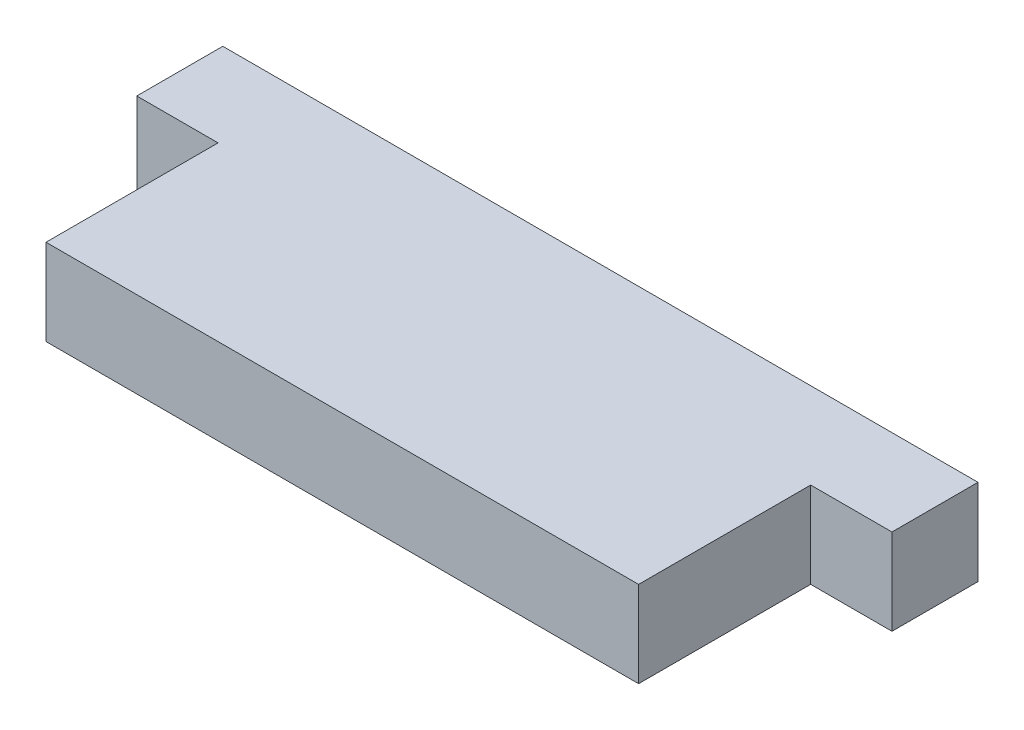
ISO-10303-21;
HEADER;
FILE_DESCRIPTION(('STEP AP214'),'2;1');
FILE_NAME('part.step','',(''),(''),'','','');
FILE_SCHEMA(('AUTOMOTIVE_DESIGN { 1 0 10303 214 1 1 1 1 }'));
ENDSEC;
DATA;
#1=APPLICATION_CONTEXT('core data for automotive mechanical design processes');
#2=APPLICATION_PROTOCOL_DEFINITION('international standard','automotive_design',2000,#1);
#3=PRODUCT_CONTEXT('',#1,'mechanical');
#4=PRODUCT('Part','Part','',(#3));
#5=PRODUCT_RELATED_PRODUCT_CATEGORY('part','',(#4));
#6=PRODUCT_DEFINITION_FORMATION('','',#4);
#7=PRODUCT_DEFINITION_CONTEXT('part definition',#1,'design');
#8=PRODUCT_DEFINITION('design','',#6,#7);
#9=PRODUCT_DEFINITION_SHAPE('','',#8);
#10=(LENGTH_UNIT() NAMED_UNIT(*) SI_UNIT(.MILLI.,.METRE.));
#11=(NAMED_UNIT(*) PLANE_ANGLE_UNIT() SI_UNIT($,.RADIAN.));
#12=(NAMED_UNIT(*) SI_UNIT($,.STERADIAN.) SOLID_ANGLE_UNIT());
#13=UNCERTAINTY_MEASURE_WITH_UNIT(LENGTH_MEASURE(1.E-05),#10,'distance_accuracy_value','');
#14=(GEOMETRIC_REPRESENTATION_CONTEXT(3) GLOBAL_UNCERTAINTY_ASSIGNED_CONTEXT((#13)) GLOBAL_UNIT_ASSIGNED_CONTEXT((#10,
#11,#12)) REPRESENTATION_CONTEXT('',''));
#15=CARTESIAN_POINT('',(0.,0.,0.));
#16=DIRECTION('',(0.,0.,1.));
#17=DIRECTION('',(1.,0.,0.));
#18=AXIS2_PLACEMENT_3D('',#15,#16,#17);
#19=CARTESIAN_POINT('',(0.,6.35,0.));
#20=DIRECTION('',(0.,0.,-1.));
#21=DIRECTION('',(-1.,0.,0.));
#22=AXIS2_PLACEMENT_3D('',#19,#20,#21);
#23=PLANE('',#22);
#24=DIRECTION('',(1.,0.,0.));
#25=VECTOR('',#24,1.);
#26=CARTESIAN_POINT('',(0.,0.,0.));
#27=LINE('',#26,#25);
#28=CARTESIAN_POINT('',(0.,0.,0.));
#29=VERTEX_POINT('',#28);
#30=CARTESIAN_POINT('',(43.739999896,0.,0.));
#31=VERTEX_POINT('',#30);
#32=EDGE_CURVE('E129',#29,#31,#27,.T.);
#33=ORIENTED_EDGE('',*,*,#32,.T.);
#34=DIRECTION('',(0.,-1.,0.));
#35=VECTOR('',#34,1.);
#36=CARTESIAN_POINT('',(43.739999896,6.35,0.));
#37=LINE('',#36,#35);
#38=CARTESIAN_POINT('',(43.739999896,6.35,0.));
#39=VERTEX_POINT('',#38);
#40=EDGE_CURVE('E11',#39,#31,#37,.T.);
#41=ORIENTED_EDGE('',*,*,#40,.F.);
#42=DIRECTION('',(1.,0.,0.));
#43=VECTOR('',#42,1.);
#44=CARTESIAN_POINT('',(0.,6.35,0.));
#45=LINE('',#44,#43);
#46=CARTESIAN_POINT('',(0.,6.35,0.));
#47=VERTEX_POINT('',#46);
#48=EDGE_CURVE('E143',#47,#39,#45,.T.);
#49=ORIENTED_EDGE('',*,*,#48,.F.);
#50=DIRECTION('',(0.,-1.,0.));
#51=VECTOR('',#50,1.);
#52=CARTESIAN_POINT('',(0.,6.35,0.));
#53=LINE('',#52,#51);
#54=EDGE_CURVE('E125',#47,#29,#53,.T.);
#55=ORIENTED_EDGE('',*,*,#54,.T.);
#56=EDGE_LOOP('',(#33,#41,#49,#55));
#57=FACE_BOUND('',#56,.T.);
#58=ADVANCED_FACE('F33',(#57),#23,.F.);
#59=CARTESIAN_POINT('',(43.739999896,6.35,0.));
#60=DIRECTION('',(-1.,0.,0.));
#61=DIRECTION('',(0.,0.,1.));
#62=AXIS2_PLACEMENT_3D('',#59,#60,#61);
#63=PLANE('',#62);
#64=DIRECTION('',(0.,0.,-1.));
#65=VECTOR('',#64,1.);
#66=CARTESIAN_POINT('',(43.739999896,0.,0.));
#67=LINE('',#66,#65);
#68=CARTESIAN_POINT('',(43.739999896,0.,-12.7));
#69=VERTEX_POINT('',#68);
#70=EDGE_CURVE('E132',#31,#69,#67,.T.);
#71=ORIENTED_EDGE('',*,*,#70,.T.);
#72=DIRECTION('',(0.,-1.,0.));
#73=VECTOR('',#72,1.);
#74=CARTESIAN_POINT('',(43.739999896,6.35,-12.7));
#75=LINE('',#74,#73);
#76=CARTESIAN_POINT('',(43.739999896,6.35,-12.7));
#77=VERTEX_POINT('',#76);
#78=EDGE_CURVE('E41',#77,#69,#75,.T.);
#79=ORIENTED_EDGE('',*,*,#78,.F.);
#80=DIRECTION('',(0.,0.,-1.));
#81=VECTOR('',#80,1.);
#82=CARTESIAN_POINT('',(43.739999896,6.35,0.));
#83=LINE('',#82,#81);
#84=EDGE_CURVE('E92',#39,#77,#83,.T.);
#85=ORIENTED_EDGE('',*,*,#84,.F.);
#86=ORIENTED_EDGE('',*,*,#40,.T.);
#87=EDGE_LOOP('',(#71,#79,#85,#86));
#88=FACE_BOUND('',#87,.T.);
#89=ADVANCED_FACE('F178',(#88),#63,.F.);
#90=CARTESIAN_POINT('',(43.739999896,6.35,-12.7));
#91=DIRECTION('',(0.,0.,-1.));
#92=DIRECTION('',(-1.,0.,0.));
#93=AXIS2_PLACEMENT_3D('',#90,#91,#92);
#94=PLANE('',#93);
#95=DIRECTION('',(1.,0.,0.));
#96=VECTOR('',#95,1.);
#97=CARTESIAN_POINT('',(43.739999896,0.,-12.7));
#98=LINE('',#97,#96);
#99=CARTESIAN_POINT('',(49.740089496,0.,-12.7));
#100=VERTEX_POINT('',#99);
#101=EDGE_CURVE('E134',#69,#100,#98,.T.);
#102=ORIENTED_EDGE('',*,*,#101,.T.);
#103=DIRECTION('',(0.,-1.,0.));
#104=VECTOR('',#103,1.);
#105=CARTESIAN_POINT('',(49.740089496,6.35,-12.7));
#106=LINE('',#105,#104);
#107=CARTESIAN_POINT('',(49.740089496,6.35,-12.7));
#108=VERTEX_POINT('',#107);
#109=EDGE_CURVE('E150',#108,#100,#106,.T.);
#110=ORIENTED_EDGE('',*,*,#109,.F.);
#111=DIRECTION('',(1.,0.,0.));
#112=VECTOR('',#111,1.);
#113=CARTESIAN_POINT('',(43.739999896,6.35,-12.7));
#114=LINE('',#113,#112);
#115=EDGE_CURVE('E158',#77,#108,#114,.T.);
#116=ORIENTED_EDGE('',*,*,#115,.F.);
#117=ORIENTED_EDGE('',*,*,#78,.T.);
#118=EDGE_LOOP('',(#102,#110,#116,#117));
#119=FACE_BOUND('',#118,.T.);
#120=ADVANCED_FACE('F156',(#119),#94,.F.);
#121=CARTESIAN_POINT('',(49.740089496,6.35,-19.05));
#122=DIRECTION('',(-1.,0.,0.));
#123=DIRECTION('',(0.,0.,1.));
#124=AXIS2_PLACEMENT_3D('',#121,#122,#123);
#125=PLANE('',#124);
#126=DIRECTION('',(0.,0.,-1.));
#127=VECTOR('',#126,1.);
#128=CARTESIAN_POINT('',(49.740089496,0.,-19.05));
#129=LINE('',#128,#127);
#130=CARTESIAN_POINT('',(49.740089496,0.,-19.05));
#131=VERTEX_POINT('',#130);
#132=EDGE_CURVE('E136',#100,#131,#129,.T.);
#133=ORIENTED_EDGE('',*,*,#132,.T.);
#134=DIRECTION('',(0.,-1.,0.));
#135=VECTOR('',#134,1.);
#136=CARTESIAN_POINT('',(49.740089496,6.35,-19.05));
#137=LINE('',#136,#135);
#138=CARTESIAN_POINT('',(49.740089496,6.35,-19.05));
#139=VERTEX_POINT('',#138);
#140=EDGE_CURVE('E147',#139,#131,#137,.T.);
#141=ORIENTED_EDGE('',*,*,#140,.F.);
#142=DIRECTION('',(0.,0.,-1.));
#143=VECTOR('',#142,1.);
#144=CARTESIAN_POINT('',(49.740089496,6.35,-19.05));
#145=LINE('',#144,#143);
#146=EDGE_CURVE('E170',#108,#139,#145,.T.);
#147=ORIENTED_EDGE('',*,*,#146,.F.);
#148=ORIENTED_EDGE('',*,*,#109,.T.);
#149=EDGE_LOOP('',(#133,#141,#147,#148));
#150=FACE_BOUND('',#149,.T.);
#151=ADVANCED_FACE('F166',(#150),#125,.F.);
#152=CARTESIAN_POINT('',(-6.0000896,6.35,-19.05));
#153=DIRECTION('',(0.,0.,1.));
#154=DIRECTION('',(1.,0.,0.));
#155=AXIS2_PLACEMENT_3D('',#152,#153,#154);
#156=PLANE('',#155);
#157=DIRECTION('',(-1.,0.,0.));
#158=VECTOR('',#157,1.);
#159=CARTESIAN_POINT('',(-6.0000896,0.,-19.05));
#160=LINE('',#159,#158);
#161=CARTESIAN_POINT('',(-6.0000896,0.,-19.05));
#162=VERTEX_POINT('',#161);
#163=EDGE_CURVE('E138',#131,#162,#160,.T.);
#164=ORIENTED_EDGE('',*,*,#163,.T.);
#165=DIRECTION('',(0.,-1.,0.));
#166=VECTOR('',#165,1.);
#167=CARTESIAN_POINT('',(-6.0000896,6.35,-19.05));
#168=LINE('',#167,#166);
#169=CARTESIAN_POINT('',(-6.0000896,6.35,-19.05));
#170=VERTEX_POINT('',#169);
#171=EDGE_CURVE('E120',#170,#162,#168,.T.);
#172=ORIENTED_EDGE('',*,*,#171,.F.);
#173=DIRECTION('',(-1.,0.,0.));
#174=VECTOR('',#173,1.);
#175=CARTESIAN_POINT('',(-6.0000896,6.35,-19.05));
#176=LINE('',#175,#174);
#177=EDGE_CURVE('E111',#139,#170,#176,.T.);
#178=ORIENTED_EDGE('',*,*,#177,.F.);
#179=ORIENTED_EDGE('',*,*,#140,.T.);
#180=EDGE_LOOP('',(#164,#172,#178,#179));
#181=FACE_BOUND('',#180,.T.);
#182=ADVANCED_FACE('F169',(#181),#156,.F.);
#183=CARTESIAN_POINT('',(-6.0000896,6.35,-19.05));
#184=DIRECTION('',(1.,0.,0.));
#185=DIRECTION('',(0.,0.,-1.));
#186=AXIS2_PLACEMENT_3D('',#183,#184,#185);
#187=PLANE('',#186);
#188=DIRECTION('',(0.,0.,1.));
#189=VECTOR('',#188,1.);
#190=CARTESIAN_POINT('',(-6.0000896,0.,-19.05));
#191=LINE('',#190,#189);
#192=CARTESIAN_POINT('',(-6.0000896,0.,-12.7));
#193=VERTEX_POINT('',#192);
#194=EDGE_CURVE('E119',#162,#193,#191,.T.);
#195=ORIENTED_EDGE('',*,*,#194,.T.);
#196=DIRECTION('',(0.,-1.,0.));
#197=VECTOR('',#196,1.);
#198=CARTESIAN_POINT('',(-6.0000896,6.35,-12.7));
#199=LINE('',#198,#197);
#200=CARTESIAN_POINT('',(-6.0000896,6.35,-12.7));
#201=VERTEX_POINT('',#200);
#202=EDGE_CURVE('E116',#201,#193,#199,.T.);
#203=ORIENTED_EDGE('',*,*,#202,.F.);
#204=DIRECTION('',(0.,0.,1.));
#205=VECTOR('',#204,1.);
#206=CARTESIAN_POINT('',(-6.0000896,6.35,-19.05));
#207=LINE('',#206,#205);
#208=EDGE_CURVE('E105',#170,#201,#207,.T.);
#209=ORIENTED_EDGE('',*,*,#208,.F.);
#210=ORIENTED_EDGE('',*,*,#171,.T.);
#211=EDGE_LOOP('',(#195,#203,#209,#210));
#212=FACE_BOUND('',#211,.T.);
#213=ADVANCED_FACE('F117',(#212),#187,.F.);
#214=CARTESIAN_POINT('',(-6.0000896,6.35,-12.7));
#215=DIRECTION('',(0.,0.,-1.));
#216=DIRECTION('',(-1.,0.,0.));
#217=AXIS2_PLACEMENT_3D('',#214,#215,#216);
#218=PLANE('',#217);
#219=DIRECTION('',(1.,0.,0.));
#220=VECTOR('',#219,1.);
#221=CARTESIAN_POINT('',(-6.0000896,0.,-12.7));
#222=LINE('',#221,#220);
#223=CARTESIAN_POINT('',(0.,0.,-12.7));
#224=VERTEX_POINT('',#223);
#225=EDGE_CURVE('E78',#193,#224,#222,.T.);
#226=ORIENTED_EDGE('',*,*,#225,.T.);
#227=DIRECTION('',(0.,-1.,0.));
#228=VECTOR('',#227,1.);
#229=CARTESIAN_POINT('',(0.,6.35,-12.7));
#230=LINE('',#229,#228);
#231=CARTESIAN_POINT('',(0.,6.35,-12.7));
#232=VERTEX_POINT('',#231);
#233=EDGE_CURVE('E121',#232,#224,#230,.T.);
#234=ORIENTED_EDGE('',*,*,#233,.F.);
#235=DIRECTION('',(1.,0.,0.));
#236=VECTOR('',#235,1.);
#237=CARTESIAN_POINT('',(-6.0000896,6.35,-12.7));
#238=LINE('',#237,#236);
#239=EDGE_CURVE('E109',#201,#232,#238,.T.);
#240=ORIENTED_EDGE('',*,*,#239,.F.);
#241=ORIENTED_EDGE('',*,*,#202,.T.);
#242=EDGE_LOOP('',(#226,#234,#240,#241));
#243=FACE_BOUND('',#242,.T.);
#244=ADVANCED_FACE('F123',(#243),#218,.F.);
#245=CARTESIAN_POINT('',(0.,6.35,0.));
#246=DIRECTION('',(1.,0.,0.));
#247=DIRECTION('',(0.,0.,-1.));
#248=AXIS2_PLACEMENT_3D('',#245,#246,#247);
#249=PLANE('',#248);
#250=DIRECTION('',(0.,0.,1.));
#251=VECTOR('',#250,1.);
#252=CARTESIAN_POINT('',(0.,0.,0.));
#253=LINE('',#252,#251);
#254=EDGE_CURVE('E84',#224,#29,#253,.T.);
#255=ORIENTED_EDGE('',*,*,#254,.T.);
#256=ORIENTED_EDGE('',*,*,#54,.F.);
#257=DIRECTION('',(0.,0.,1.));
#258=VECTOR('',#257,1.);
#259=CARTESIAN_POINT('',(0.,6.35,0.));
#260=LINE('',#259,#258);
#261=EDGE_CURVE('E49',#232,#47,#260,.T.);
#262=ORIENTED_EDGE('',*,*,#261,.F.);
#263=ORIENTED_EDGE('',*,*,#233,.T.);
#264=EDGE_LOOP('',(#255,#256,#262,#263));
#265=FACE_BOUND('',#264,.T.);
#266=ADVANCED_FACE('F194',(#265),#249,.F.);
#267=CARTESIAN_POINT('',(0.,6.35,0.));
#268=DIRECTION('',(0.,1.,0.));
#269=DIRECTION('',(0.,0.,1.));
#270=AXIS2_PLACEMENT_3D('',#267,#268,#269);
#271=PLANE('',#270);
#272=ORIENTED_EDGE('',*,*,#48,.T.);
#273=ORIENTED_EDGE('',*,*,#84,.T.);
#274=ORIENTED_EDGE('',*,*,#115,.T.);
#275=ORIENTED_EDGE('',*,*,#146,.T.);
#276=ORIENTED_EDGE('',*,*,#177,.T.);
#277=ORIENTED_EDGE('',*,*,#208,.T.);
#278=ORIENTED_EDGE('',*,*,#239,.T.);
#279=ORIENTED_EDGE('',*,*,#261,.T.);
#280=EDGE_LOOP('',(#272,#273,#274,#275,#276,#277,#278,#279));
#281=FACE_BOUND('',#280,.T.);
#282=ADVANCED_FACE('F107',(#281),#271,.T.);
#283=CARTESIAN_POINT('',(0.,0.,0.));
#284=DIRECTION('',(0.,1.,0.));
#285=DIRECTION('',(0.,0.,1.));
#286=AXIS2_PLACEMENT_3D('',#283,#284,#285);
#287=PLANE('',#286);
#288=ORIENTED_EDGE('',*,*,#32,.F.);
#289=ORIENTED_EDGE('',*,*,#254,.F.);
#290=ORIENTED_EDGE('',*,*,#225,.F.);
#291=ORIENTED_EDGE('',*,*,#194,.F.);
#292=ORIENTED_EDGE('',*,*,#163,.F.);
#293=ORIENTED_EDGE('',*,*,#132,.F.);
#294=ORIENTED_EDGE('',*,*,#101,.F.);
#295=ORIENTED_EDGE('',*,*,#70,.F.);
#296=EDGE_LOOP('',(#288,#289,#290,#291,#292,#293,#294,#295));
#297=FACE_BOUND('',#296,.T.);
#298=ADVANCED_FACE('F162',(#297),#287,.F.);
#299=CLOSED_SHELL('',(#58,#89,#120,#151,#182,#213,#244,#266,#282,#298));
#300=MANIFOLD_SOLID_BREP('B2',#299);
#301=ADVANCED_BREP_SHAPE_REPRESENTATION('',(#18,#300),#14);
#302=SHAPE_DEFINITION_REPRESENTATION(#9,#301);
ENDSEC;
END-ISO-10303-21;
